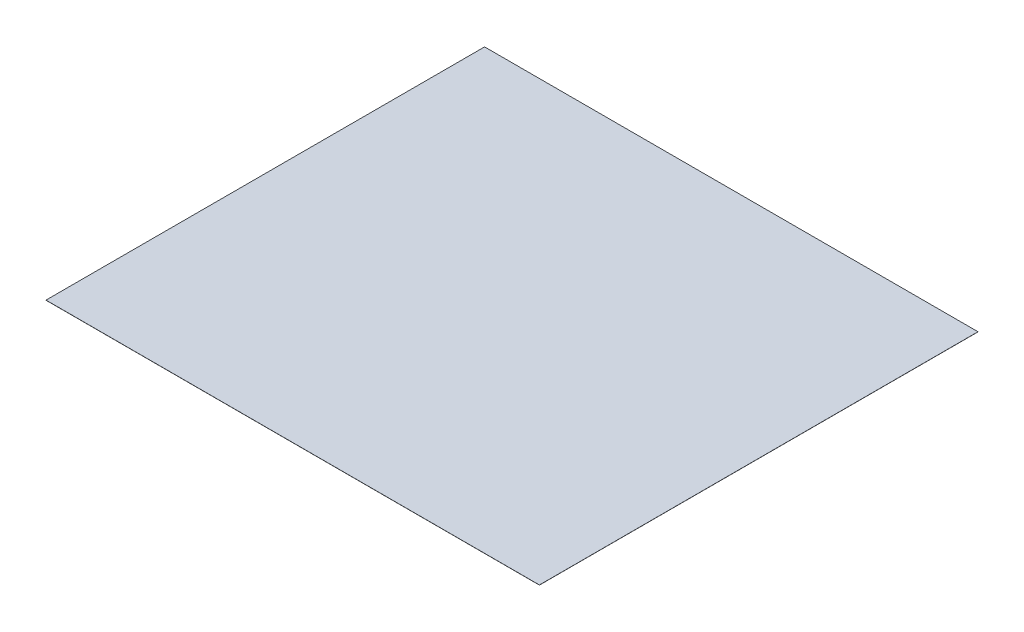
ISO-10303-21;
HEADER;
FILE_DESCRIPTION(('STEP AP214'),'2;1');
FILE_NAME('part.step','',(''),(''),'','','');
FILE_SCHEMA(('AUTOMOTIVE_DESIGN { 1 0 10303 214 1 1 1 1 }'));
ENDSEC;
DATA;
#1=APPLICATION_CONTEXT('core data for automotive mechanical design processes');
#2=APPLICATION_PROTOCOL_DEFINITION('international standard','automotive_design',2000,#1);
#3=PRODUCT_CONTEXT('',#1,'mechanical');
#4=PRODUCT('Part','Part','',(#3));
#5=PRODUCT_RELATED_PRODUCT_CATEGORY('part','',(#4));
#6=PRODUCT_DEFINITION_FORMATION('','',#4);
#7=PRODUCT_DEFINITION_CONTEXT('part definition',#1,'design');
#8=PRODUCT_DEFINITION('design','',#6,#7);
#9=PRODUCT_DEFINITION_SHAPE('','',#8);
#10=(LENGTH_UNIT() NAMED_UNIT(*) SI_UNIT(.MILLI.,.METRE.));
#11=(NAMED_UNIT(*) PLANE_ANGLE_UNIT() SI_UNIT($,.RADIAN.));
#12=(NAMED_UNIT(*) SI_UNIT($,.STERADIAN.) SOLID_ANGLE_UNIT());
#13=UNCERTAINTY_MEASURE_WITH_UNIT(LENGTH_MEASURE(1.E-05),#10,'distance_accuracy_value','');
#14=(GEOMETRIC_REPRESENTATION_CONTEXT(3) GLOBAL_UNCERTAINTY_ASSIGNED_CONTEXT((#13)) GLOBAL_UNIT_ASSIGNED_CONTEXT((#10,
#11,#12)) REPRESENTATION_CONTEXT('',''));
#15=CARTESIAN_POINT('',(0.,0.,0.));
#16=DIRECTION('',(0.,0.,1.));
#17=DIRECTION('',(1.,0.,0.));
#18=AXIS2_PLACEMENT_3D('',#15,#16,#17);
#19=CARTESIAN_POINT('',(2743.2,1.5875,2438.4));
#20=DIRECTION('',(-1.,0.,0.));
#21=DIRECTION('',(0.,0.,1.));
#22=AXIS2_PLACEMENT_3D('',#19,#20,#21);
#23=PLANE('',#22);
#24=DIRECTION('',(0.,0.,-1.));
#25=VECTOR('',#24,1.);
#26=CARTESIAN_POINT('',(2743.2,0.,2438.4));
#27=LINE('',#26,#25);
#28=CARTESIAN_POINT('',(2743.2,0.,2438.4));
#29=VERTEX_POINT('',#28);
#30=CARTESIAN_POINT('',(2743.2,0.,-2438.4));
#31=VERTEX_POINT('',#30);
#32=EDGE_CURVE('E100',#29,#31,#27,.T.);
#33=ORIENTED_EDGE('',*,*,#32,.T.);
#34=DIRECTION('',(0.,-1.,0.));
#35=VECTOR('',#34,1.);
#36=CARTESIAN_POINT('',(2743.2,1.5875,-2438.4));
#37=LINE('',#36,#35);
#38=CARTESIAN_POINT('',(2743.2,1.5875,-2438.4));
#39=VERTEX_POINT('',#38);
#40=EDGE_CURVE('E11',#39,#31,#37,.T.);
#41=ORIENTED_EDGE('',*,*,#40,.F.);
#42=DIRECTION('',(0.,0.,-1.));
#43=VECTOR('',#42,1.);
#44=CARTESIAN_POINT('',(2743.2,1.5875,2438.4));
#45=LINE('',#44,#43);
#46=CARTESIAN_POINT('',(2743.2,1.5875,2438.4));
#47=VERTEX_POINT('',#46);
#48=EDGE_CURVE('E88',#47,#39,#45,.T.);
#49=ORIENTED_EDGE('',*,*,#48,.F.);
#50=DIRECTION('',(0.,-1.,0.));
#51=VECTOR('',#50,1.);
#52=CARTESIAN_POINT('',(2743.2,1.5875,2438.4));
#53=LINE('',#52,#51);
#54=EDGE_CURVE('E96',#47,#29,#53,.T.);
#55=ORIENTED_EDGE('',*,*,#54,.T.);
#56=EDGE_LOOP('',(#33,#41,#49,#55));
#57=FACE_BOUND('',#56,.T.);
#58=ADVANCED_FACE('F37',(#57),#23,.F.);
#59=CARTESIAN_POINT('',(-2743.2,1.5875,-2438.4));
#60=DIRECTION('',(0.,0.,1.));
#61=DIRECTION('',(1.,0.,0.));
#62=AXIS2_PLACEMENT_3D('',#59,#60,#61);
#63=PLANE('',#62);
#64=DIRECTION('',(-1.,0.,0.));
#65=VECTOR('',#64,1.);
#66=CARTESIAN_POINT('',(-2743.2,0.,-2438.4));
#67=LINE('',#66,#65);
#68=CARTESIAN_POINT('',(-2743.2,0.,-2438.4));
#69=VERTEX_POINT('',#68);
#70=EDGE_CURVE('E92',#31,#69,#67,.T.);
#71=ORIENTED_EDGE('',*,*,#70,.T.);
#72=DIRECTION('',(0.,-1.,0.));
#73=VECTOR('',#72,1.);
#74=CARTESIAN_POINT('',(-2743.2,1.5875,-2438.4));
#75=LINE('',#74,#73);
#76=CARTESIAN_POINT('',(-2743.2,1.5875,-2438.4));
#77=VERTEX_POINT('',#76);
#78=EDGE_CURVE('E45',#77,#69,#75,.T.);
#79=ORIENTED_EDGE('',*,*,#78,.F.);
#80=DIRECTION('',(-1.,0.,0.));
#81=VECTOR('',#80,1.);
#82=CARTESIAN_POINT('',(-2743.2,1.5875,-2438.4));
#83=LINE('',#82,#81);
#84=EDGE_CURVE('E83',#39,#77,#83,.T.);
#85=ORIENTED_EDGE('',*,*,#84,.F.);
#86=ORIENTED_EDGE('',*,*,#40,.T.);
#87=EDGE_LOOP('',(#71,#79,#85,#86));
#88=FACE_BOUND('',#87,.T.);
#89=ADVANCED_FACE('F91',(#88),#63,.F.);
#90=CARTESIAN_POINT('',(-2743.2,1.5875,2438.4));
#91=DIRECTION('',(1.,0.,0.));
#92=DIRECTION('',(0.,0.,-1.));
#93=AXIS2_PLACEMENT_3D('',#90,#91,#92);
#94=PLANE('',#93);
#95=DIRECTION('',(0.,0.,1.));
#96=VECTOR('',#95,1.);
#97=CARTESIAN_POINT('',(-2743.2,0.,2438.4));
#98=LINE('',#97,#96);
#99=CARTESIAN_POINT('',(-2743.2,0.,2438.4));
#100=VERTEX_POINT('',#99);
#101=EDGE_CURVE('E70',#69,#100,#98,.T.);
#102=ORIENTED_EDGE('',*,*,#101,.T.);
#103=DIRECTION('',(0.,-1.,0.));
#104=VECTOR('',#103,1.);
#105=CARTESIAN_POINT('',(-2743.2,1.5875,2438.4));
#106=LINE('',#105,#104);
#107=CARTESIAN_POINT('',(-2743.2,1.5875,2438.4));
#108=VERTEX_POINT('',#107);
#109=EDGE_CURVE('E93',#108,#100,#106,.T.);
#110=ORIENTED_EDGE('',*,*,#109,.F.);
#111=DIRECTION('',(0.,0.,1.));
#112=VECTOR('',#111,1.);
#113=CARTESIAN_POINT('',(-2743.2,1.5875,2438.4));
#114=LINE('',#113,#112);
#115=EDGE_CURVE('E86',#77,#108,#114,.T.);
#116=ORIENTED_EDGE('',*,*,#115,.F.);
#117=ORIENTED_EDGE('',*,*,#78,.T.);
#118=EDGE_LOOP('',(#102,#110,#116,#117));
#119=FACE_BOUND('',#118,.T.);
#120=ADVANCED_FACE('F94',(#119),#94,.F.);
#121=CARTESIAN_POINT('',(-2743.2,1.5875,2438.4));
#122=DIRECTION('',(0.,0.,-1.));
#123=DIRECTION('',(-1.,0.,0.));
#124=AXIS2_PLACEMENT_3D('',#121,#122,#123);
#125=PLANE('',#124);
#126=DIRECTION('',(1.,0.,0.));
#127=VECTOR('',#126,1.);
#128=CARTESIAN_POINT('',(-2743.2,0.,2438.4));
#129=LINE('',#128,#127);
#130=EDGE_CURVE('E76',#100,#29,#129,.T.);
#131=ORIENTED_EDGE('',*,*,#130,.T.);
#132=ORIENTED_EDGE('',*,*,#54,.F.);
#133=DIRECTION('',(1.,0.,0.));
#134=VECTOR('',#133,1.);
#135=CARTESIAN_POINT('',(-2743.2,1.5875,2438.4));
#136=LINE('',#135,#134);
#137=EDGE_CURVE('E53',#108,#47,#136,.T.);
#138=ORIENTED_EDGE('',*,*,#137,.F.);
#139=ORIENTED_EDGE('',*,*,#109,.T.);
#140=EDGE_LOOP('',(#131,#132,#138,#139));
#141=FACE_BOUND('',#140,.T.);
#142=ADVANCED_FACE('F107',(#141),#125,.F.);
#143=CARTESIAN_POINT('',(0.,1.5875,0.));
#144=DIRECTION('',(0.,-1.,0.));
#145=DIRECTION('',(0.,0.,-1.));
#146=AXIS2_PLACEMENT_3D('',#143,#144,#145);
#147=PLANE('',#146);
#148=ORIENTED_EDGE('',*,*,#48,.T.);
#149=ORIENTED_EDGE('',*,*,#84,.T.);
#150=ORIENTED_EDGE('',*,*,#115,.T.);
#151=ORIENTED_EDGE('',*,*,#137,.T.);
#152=EDGE_LOOP('',(#148,#149,#150,#151));
#153=FACE_BOUND('',#152,.T.);
#154=ADVANCED_FACE('F84',(#153),#147,.F.);
#155=CARTESIAN_POINT('',(0.,0.,0.));
#156=DIRECTION('',(0.,-1.,0.));
#157=DIRECTION('',(0.,0.,-1.));
#158=AXIS2_PLACEMENT_3D('',#155,#156,#157);
#159=PLANE('',#158);
#160=ORIENTED_EDGE('',*,*,#32,.F.);
#161=ORIENTED_EDGE('',*,*,#130,.F.);
#162=ORIENTED_EDGE('',*,*,#101,.F.);
#163=ORIENTED_EDGE('',*,*,#70,.F.);
#164=EDGE_LOOP('',(#160,#161,#162,#163));
#165=FACE_BOUND('',#164,.T.);
#166=ADVANCED_FACE('F110',(#165),#159,.T.);
#167=CLOSED_SHELL('',(#58,#89,#120,#142,#154,#166));
#168=MANIFOLD_SOLID_BREP('B2',#167);
#169=ADVANCED_BREP_SHAPE_REPRESENTATION('',(#18,#168),#14);
#170=SHAPE_DEFINITION_REPRESENTATION(#9,#169);
ENDSEC;
END-ISO-10303-21;
